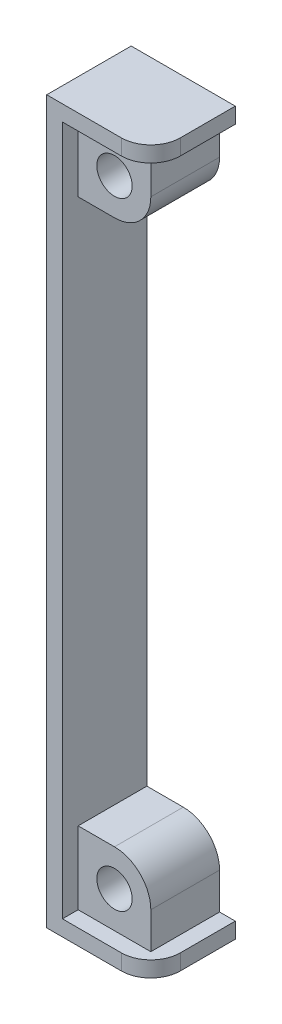
ISO-10303-21;
HEADER;
FILE_DESCRIPTION(('STEP AP214'),'2;1');
FILE_NAME('part.step','',(''),(''),'','','');
FILE_SCHEMA(('AUTOMOTIVE_DESIGN { 1 0 10303 214 1 1 1 1 }'));
ENDSEC;
DATA;
#1=APPLICATION_CONTEXT('core data for automotive mechanical design processes');
#2=APPLICATION_PROTOCOL_DEFINITION('international standard','automotive_design',2000,#1);
#3=PRODUCT_CONTEXT('',#1,'mechanical');
#4=PRODUCT('Part','Part','',(#3));
#5=PRODUCT_RELATED_PRODUCT_CATEGORY('part','',(#4));
#6=PRODUCT_DEFINITION_FORMATION('','',#4);
#7=PRODUCT_DEFINITION_CONTEXT('part definition',#1,'design');
#8=PRODUCT_DEFINITION('design','',#6,#7);
#9=PRODUCT_DEFINITION_SHAPE('','',#8);
#10=(LENGTH_UNIT() NAMED_UNIT(*) SI_UNIT(.MILLI.,.METRE.));
#11=(NAMED_UNIT(*) PLANE_ANGLE_UNIT() SI_UNIT($,.RADIAN.));
#12=(NAMED_UNIT(*) SI_UNIT($,.STERADIAN.) SOLID_ANGLE_UNIT());
#13=UNCERTAINTY_MEASURE_WITH_UNIT(LENGTH_MEASURE(1.E-05),#10,'distance_accuracy_value','');
#14=(GEOMETRIC_REPRESENTATION_CONTEXT(3) GLOBAL_UNCERTAINTY_ASSIGNED_CONTEXT((#13)) GLOBAL_UNIT_ASSIGNED_CONTEXT((#10,
#11,#12)) REPRESENTATION_CONTEXT('',''));
#15=CARTESIAN_POINT('',(0.,0.,0.));
#16=DIRECTION('',(0.,0.,1.));
#17=DIRECTION('',(1.,0.,0.));
#18=AXIS2_PLACEMENT_3D('',#15,#16,#17);
#19=CARTESIAN_POINT('',(1.60000000000001,0.,8.6));
#20=DIRECTION('',(1.,0.,0.));
#21=DIRECTION('',(0.,1.,0.));
#22=AXIS2_PLACEMENT_3D('',#19,#20,#21);
#23=PLANE('',#22);
#24=DIRECTION('',(0.,-1.,0.));
#25=VECTOR('',#24,1.);
#26=CARTESIAN_POINT('',(1.60000000000001,0.,7.));
#27=LINE('',#26,#25);
#28=CARTESIAN_POINT('',(1.60000000000001,9.,7.));
#29=VERTEX_POINT('',#28);
#30=CARTESIAN_POINT('',(1.60000000000001,1.6,7.));
#31=VERTEX_POINT('',#30);
#32=EDGE_CURVE('E188',#29,#31,#27,.T.);
#33=ORIENTED_EDGE('',*,*,#32,.F.);
#34=DIRECTION('',(0.,0.,-1.));
#35=VECTOR('',#34,1.);
#36=CARTESIAN_POINT('',(1.60000000000001,9.,7.));
#37=LINE('',#36,#35);
#38=CARTESIAN_POINT('',(1.60000000000001,9.,0.));
#39=VERTEX_POINT('',#38);
#40=EDGE_CURVE('E200',#29,#39,#37,.T.);
#41=ORIENTED_EDGE('',*,*,#40,.T.);
#42=DIRECTION('',(0.,-1.,0.));
#43=VECTOR('',#42,1.);
#44=CARTESIAN_POINT('',(1.60000000000001,0.,0.));
#45=LINE('',#44,#43);
#46=CARTESIAN_POINT('',(1.6,64.465,0.));
#47=VERTEX_POINT('',#46);
#48=EDGE_CURVE('E225',#47,#39,#45,.T.);
#49=ORIENTED_EDGE('',*,*,#48,.F.);
#50=DIRECTION('',(0.,0.,-1.));
#51=VECTOR('',#50,1.);
#52=CARTESIAN_POINT('',(1.6,64.465,7.));
#53=LINE('',#52,#51);
#54=CARTESIAN_POINT('',(1.6,64.465,7.));
#55=VERTEX_POINT('',#54);
#56=EDGE_CURVE('E281',#55,#47,#53,.T.);
#57=ORIENTED_EDGE('',*,*,#56,.F.);
#58=DIRECTION('',(0.,-1.,0.));
#59=VECTOR('',#58,1.);
#60=CARTESIAN_POINT('',(1.60000000000001,0.,7.));
#61=LINE('',#60,#59);
#62=CARTESIAN_POINT('',(1.6,71.865,7.));
#63=VERTEX_POINT('',#62);
#64=EDGE_CURVE('E278',#63,#55,#61,.T.);
#65=ORIENTED_EDGE('',*,*,#64,.F.);
#66=DIRECTION('',(0.,0.,-1.));
#67=VECTOR('',#66,1.);
#68=CARTESIAN_POINT('',(1.6,71.865,8.6));
#69=LINE('',#68,#67);
#70=CARTESIAN_POINT('',(1.6,71.865,8.6));
#71=VERTEX_POINT('',#70);
#72=EDGE_CURVE('E256',#71,#63,#69,.T.);
#73=ORIENTED_EDGE('',*,*,#72,.F.);
#74=DIRECTION('',(0.,-1.,0.));
#75=VECTOR('',#74,1.);
#76=CARTESIAN_POINT('',(1.60000000000001,0.,8.6));
#77=LINE('',#76,#75);
#78=CARTESIAN_POINT('',(1.60000000000001,1.6,8.6));
#79=VERTEX_POINT('',#78);
#80=EDGE_CURVE('E207',#71,#79,#77,.T.);
#81=ORIENTED_EDGE('',*,*,#80,.T.);
#82=DIRECTION('',(0.,0.,-1.));
#83=VECTOR('',#82,1.);
#84=CARTESIAN_POINT('',(1.60000000000001,1.6,8.6));
#85=LINE('',#84,#83);
#86=EDGE_CURVE('E259',#79,#31,#85,.T.);
#87=ORIENTED_EDGE('',*,*,#86,.T.);
#88=EDGE_LOOP('',(#33,#41,#49,#57,#65,#73,#81,#87));
#89=FACE_BOUND('',#88,.T.);
#90=ADVANCED_FACE('F33',(#89),#23,.T.);
#91=CARTESIAN_POINT('',(0.,64.465,7.));
#92=DIRECTION('',(0.,-1.,0.));
#93=DIRECTION('',(0.,0.,-1.));
#94=AXIS2_PLACEMENT_3D('',#91,#92,#93);
#95=PLANE('',#94);
#96=DIRECTION('',(-1.,0.,0.));
#97=VECTOR('',#96,1.);
#98=CARTESIAN_POINT('',(0.,64.465,0.));
#99=LINE('',#98,#97);
#100=CARTESIAN_POINT('',(5.30000000000001,64.465,0.));
#101=VERTEX_POINT('',#100);
#102=EDGE_CURVE('E284',#101,#47,#99,.T.);
#103=ORIENTED_EDGE('',*,*,#102,.F.);
#104=DIRECTION('',(0.,0.,-1.));
#105=VECTOR('',#104,1.);
#106=CARTESIAN_POINT('',(5.30000000000001,64.465,7.));
#107=LINE('',#106,#105);
#108=CARTESIAN_POINT('',(5.30000000000001,64.465,7.));
#109=VERTEX_POINT('',#108);
#110=EDGE_CURVE('E300',#109,#101,#107,.T.);
#111=ORIENTED_EDGE('',*,*,#110,.F.);
#112=DIRECTION('',(-1.,0.,0.));
#113=VECTOR('',#112,1.);
#114=CARTESIAN_POINT('',(0.,64.465,7.));
#115=LINE('',#114,#113);
#116=EDGE_CURVE('E266',#109,#55,#115,.T.);
#117=ORIENTED_EDGE('',*,*,#116,.T.);
#118=ORIENTED_EDGE('',*,*,#56,.T.);
#119=EDGE_LOOP('',(#103,#111,#117,#118));
#120=FACE_BOUND('',#119,.T.);
#121=ADVANCED_FACE('F364',(#120),#95,.T.);
#122=CARTESIAN_POINT('',(5.30000000000001,68.165,7.));
#123=DIRECTION('',(0.,0.,-1.));
#124=DIRECTION('',(-1.,0.,0.));
#125=AXIS2_PLACEMENT_3D('',#122,#123,#124);
#126=CYLINDRICAL_SURFACE('',#125,3.69999999999999);
#127=CARTESIAN_POINT('',(5.30000000000001,68.165,0.));
#128=DIRECTION('',(0.,0.,1.));
#129=DIRECTION('',(1.,0.,0.));
#130=AXIS2_PLACEMENT_3D('',#127,#128,#129);
#131=CIRCLE('',#130,3.69999999999999);
#132=CARTESIAN_POINT('',(9.,68.165,0.));
#133=VERTEX_POINT('',#132);
#134=EDGE_CURVE('E287',#101,#133,#131,.T.);
#135=ORIENTED_EDGE('',*,*,#134,.T.);
#136=DIRECTION('',(0.,0.,-1.));
#137=VECTOR('',#136,1.);
#138=CARTESIAN_POINT('',(9.,68.165,7.));
#139=LINE('',#138,#137);
#140=CARTESIAN_POINT('',(9.,68.165,7.));
#141=VERTEX_POINT('',#140);
#142=EDGE_CURVE('E297',#141,#133,#139,.T.);
#143=ORIENTED_EDGE('',*,*,#142,.F.);
#144=CARTESIAN_POINT('',(5.30000000000001,68.165,7.));
#145=DIRECTION('',(0.,0.,1.));
#146=DIRECTION('',(1.,0.,0.));
#147=AXIS2_PLACEMENT_3D('',#144,#145,#146);
#148=CIRCLE('',#147,3.69999999999999);
#149=EDGE_CURVE('E270',#109,#141,#148,.T.);
#150=ORIENTED_EDGE('',*,*,#149,.F.);
#151=ORIENTED_EDGE('',*,*,#110,.T.);
#152=EDGE_LOOP('',(#135,#143,#150,#151));
#153=FACE_BOUND('',#152,.T.);
#154=ADVANCED_FACE('F369',(#153),#126,.T.);
#155=CARTESIAN_POINT('',(9.,0.,7.));
#156=DIRECTION('',(-1.,0.,0.));
#157=DIRECTION('',(0.,0.,1.));
#158=AXIS2_PLACEMENT_3D('',#155,#156,#157);
#159=PLANE('',#158);
#160=DIRECTION('',(0.,1.,0.));
#161=VECTOR('',#160,1.);
#162=CARTESIAN_POINT('',(9.,0.,0.));
#163=LINE('',#162,#161);
#164=CARTESIAN_POINT('',(9.,71.865,0.));
#165=VERTEX_POINT('',#164);
#166=EDGE_CURVE('E267',#133,#165,#163,.T.);
#167=ORIENTED_EDGE('',*,*,#166,.T.);
#168=DIRECTION('',(0.,0.,-1.));
#169=VECTOR('',#168,1.);
#170=CARTESIAN_POINT('',(9.,71.865,7.));
#171=LINE('',#170,#169);
#172=CARTESIAN_POINT('',(9.00000000000001,71.865,7.));
#173=VERTEX_POINT('',#172);
#174=EDGE_CURVE('E294',#173,#165,#171,.T.);
#175=ORIENTED_EDGE('',*,*,#174,.F.);
#176=DIRECTION('',(0.,1.,0.));
#177=VECTOR('',#176,1.);
#178=CARTESIAN_POINT('',(9.,0.,7.));
#179=LINE('',#178,#177);
#180=EDGE_CURVE('E273',#141,#173,#179,.T.);
#181=ORIENTED_EDGE('',*,*,#180,.F.);
#182=ORIENTED_EDGE('',*,*,#142,.T.);
#183=EDGE_LOOP('',(#167,#175,#181,#182));
#184=FACE_BOUND('',#183,.T.);
#185=ADVANCED_FACE('F384',(#184),#159,.F.);
#186=CARTESIAN_POINT('',(5.30000000000001,68.165,7.));
#187=DIRECTION('',(0.,0.,-1.));
#188=DIRECTION('',(-1.,0.,0.));
#189=AXIS2_PLACEMENT_3D('',#186,#187,#188);
#190=CYLINDRICAL_SURFACE('',#189,1.8);
#191=CARTESIAN_POINT('',(5.30000000000001,68.165,7.));
#192=DIRECTION('',(0.,0.,1.));
#193=DIRECTION('',(1.,0.,0.));
#194=AXIS2_PLACEMENT_3D('',#191,#192,#193);
#195=CIRCLE('',#194,1.8);
#196=CARTESIAN_POINT('',(7.10000000000001,68.165,7.));
#197=VERTEX_POINT('',#196);
#198=EDGE_CURVE('E263',#197,#197,#195,.T.);
#199=ORIENTED_EDGE('',*,*,#198,.T.);
#200=EDGE_LOOP('',(#199));
#201=FACE_BOUND('',#200,.T.);
#202=CARTESIAN_POINT('',(5.30000000000001,68.165,0.));
#203=DIRECTION('',(0.,0.,1.));
#204=DIRECTION('',(1.,0.,0.));
#205=AXIS2_PLACEMENT_3D('',#202,#203,#204);
#206=CIRCLE('',#205,1.8);
#207=CARTESIAN_POINT('',(7.10000000000001,68.165,0.));
#208=VERTEX_POINT('',#207);
#209=EDGE_CURVE('E262',#208,#208,#206,.T.);
#210=ORIENTED_EDGE('',*,*,#209,.F.);
#211=EDGE_LOOP('',(#210));
#212=FACE_BOUND('',#211,.T.);
#213=ADVANCED_FACE('F380',(#201,#212),#190,.F.);
#214=CARTESIAN_POINT('',(0.,0.,7.));
#215=DIRECTION('',(0.,0.,1.));
#216=DIRECTION('',(1.,0.,0.));
#217=AXIS2_PLACEMENT_3D('',#214,#215,#216);
#218=PLANE('',#217);
#219=ORIENTED_EDGE('',*,*,#198,.F.);
#220=EDGE_LOOP('',(#219));
#221=FACE_BOUND('',#220,.T.);
#222=ORIENTED_EDGE('',*,*,#116,.F.);
#223=ORIENTED_EDGE('',*,*,#149,.T.);
#224=ORIENTED_EDGE('',*,*,#180,.T.);
#225=DIRECTION('',(1.,0.,0.));
#226=VECTOR('',#225,1.);
#227=CARTESIAN_POINT('',(0.,71.865,7.));
#228=LINE('',#227,#226);
#229=EDGE_CURVE('E276',#63,#173,#228,.T.);
#230=ORIENTED_EDGE('',*,*,#229,.F.);
#231=ORIENTED_EDGE('',*,*,#64,.T.);
#232=EDGE_LOOP('',(#222,#223,#224,#230,#231));
#233=FACE_BOUND('',#232,.T.);
#234=ADVANCED_FACE('F377',(#221,#233),#218,.T.);
#235=CARTESIAN_POINT('',(0.,0.,0.));
#236=DIRECTION('',(0.,0.,1.));
#237=DIRECTION('',(1.,0.,0.));
#238=AXIS2_PLACEMENT_3D('',#235,#236,#237);
#239=PLANE('',#238);
#240=DIRECTION('',(0.,-1.,0.));
#241=VECTOR('',#240,1.);
#242=CARTESIAN_POINT('',(9.00000000000001,0.,0.));
#243=LINE('',#242,#241);
#244=CARTESIAN_POINT('',(9.00000000000001,5.3,0.));
#245=VERTEX_POINT('',#244);
#246=CARTESIAN_POINT('',(9.00000000000001,1.6,0.));
#247=VERTEX_POINT('',#246);
#248=EDGE_CURVE('E163',#245,#247,#243,.T.);
#249=ORIENTED_EDGE('',*,*,#248,.T.);
#250=DIRECTION('',(1.,0.,0.));
#251=VECTOR('',#250,1.);
#252=CARTESIAN_POINT('',(0.,1.6,0.));
#253=LINE('',#252,#251);
#254=CARTESIAN_POINT('',(10.6,1.6,0.));
#255=VERTEX_POINT('',#254);
#256=EDGE_CURVE('E167',#247,#255,#253,.T.);
#257=ORIENTED_EDGE('',*,*,#256,.T.);
#258=DIRECTION('',(0.,1.,0.));
#259=VECTOR('',#258,1.);
#260=CARTESIAN_POINT('',(10.6,0.,0.));
#261=LINE('',#260,#259);
#262=CARTESIAN_POINT('',(10.6,0.,0.));
#263=VERTEX_POINT('',#262);
#264=EDGE_CURVE('E208',#263,#255,#261,.T.);
#265=ORIENTED_EDGE('',*,*,#264,.F.);
#266=DIRECTION('',(1.,0.,0.));
#267=VECTOR('',#266,1.);
#268=CARTESIAN_POINT('',(0.,0.,0.));
#269=LINE('',#268,#267);
#270=CARTESIAN_POINT('',(0.,0.,0.));
#271=VERTEX_POINT('',#270);
#272=EDGE_CURVE('E240',#271,#263,#269,.T.);
#273=ORIENTED_EDGE('',*,*,#272,.F.);
#274=DIRECTION('',(0.,1.,0.));
#275=VECTOR('',#274,1.);
#276=CARTESIAN_POINT('',(0.,0.,0.));
#277=LINE('',#276,#275);
#278=CARTESIAN_POINT('',(0.,73.465,0.));
#279=VERTEX_POINT('',#278);
#280=EDGE_CURVE('E237',#271,#279,#277,.T.);
#281=ORIENTED_EDGE('',*,*,#280,.T.);
#282=DIRECTION('',(1.,0.,0.));
#283=VECTOR('',#282,1.);
#284=CARTESIAN_POINT('',(0.,73.465,0.));
#285=LINE('',#284,#283);
#286=CARTESIAN_POINT('',(10.6,73.465,0.));
#287=VERTEX_POINT('',#286);
#288=EDGE_CURVE('E234',#279,#287,#285,.T.);
#289=ORIENTED_EDGE('',*,*,#288,.T.);
#290=DIRECTION('',(0.,1.,0.));
#291=VECTOR('',#290,1.);
#292=CARTESIAN_POINT('',(10.6,0.,0.));
#293=LINE('',#292,#291);
#294=CARTESIAN_POINT('',(10.6,71.865,0.));
#295=VERTEX_POINT('',#294);
#296=EDGE_CURVE('E231',#295,#287,#293,.T.);
#297=ORIENTED_EDGE('',*,*,#296,.F.);
#298=DIRECTION('',(1.,0.,0.));
#299=VECTOR('',#298,1.);
#300=CARTESIAN_POINT('',(0.,71.865,0.));
#301=LINE('',#300,#299);
#302=EDGE_CURVE('E228',#165,#295,#301,.T.);
#303=ORIENTED_EDGE('',*,*,#302,.F.);
#304=ORIENTED_EDGE('',*,*,#166,.F.);
#305=ORIENTED_EDGE('',*,*,#134,.F.);
#306=ORIENTED_EDGE('',*,*,#102,.T.);
#307=ORIENTED_EDGE('',*,*,#48,.T.);
#308=DIRECTION('',(-1.,0.,0.));
#309=VECTOR('',#308,1.);
#310=CARTESIAN_POINT('',(0.,9.,0.));
#311=LINE('',#310,#309);
#312=CARTESIAN_POINT('',(5.30000000000001,9.,0.));
#313=VERTEX_POINT('',#312);
#314=EDGE_CURVE('E184',#313,#39,#311,.T.);
#315=ORIENTED_EDGE('',*,*,#314,.F.);
#316=CARTESIAN_POINT('',(5.30000000000001,5.3,0.));
#317=DIRECTION('',(0.,0.,1.));
#318=DIRECTION('',(1.,0.,0.));
#319=AXIS2_PLACEMENT_3D('',#316,#317,#318);
#320=CIRCLE('',#319,3.7);
#321=EDGE_CURVE('E196',#245,#313,#320,.T.);
#322=ORIENTED_EDGE('',*,*,#321,.F.);
#323=EDGE_LOOP('',(#249,#257,#265,#273,#281,#289,#297,#303,#304,#305,#306,#307,#315,#322));
#324=FACE_BOUND('',#323,.T.);
#325=ORIENTED_EDGE('',*,*,#209,.T.);
#326=EDGE_LOOP('',(#325));
#327=FACE_BOUND('',#326,.T.);
#328=CARTESIAN_POINT('',(5.30000000000001,5.3,0.));
#329=DIRECTION('',(0.,0.,1.));
#330=DIRECTION('',(1.,0.,0.));
#331=AXIS2_PLACEMENT_3D('',#328,#329,#330);
#332=CIRCLE('',#331,1.8);
#333=CARTESIAN_POINT('',(7.10000000000001,5.3,0.));
#334=VERTEX_POINT('',#333);
#335=EDGE_CURVE('E192',#334,#334,#332,.T.);
#336=ORIENTED_EDGE('',*,*,#335,.T.);
#337=EDGE_LOOP('',(#336));
#338=FACE_BOUND('',#337,.T.);
#339=ADVANCED_FACE('F337',(#324,#327,#338),#239,.F.);
#340=CARTESIAN_POINT('',(0.,71.865,8.6));
#341=DIRECTION('',(0.,1.,0.));
#342=DIRECTION('',(0.,0.,1.));
#343=AXIS2_PLACEMENT_3D('',#340,#341,#342);
#344=PLANE('',#343);
#345=DIRECTION('',(0.,0.,-1.));
#346=VECTOR('',#345,1.);
#347=CARTESIAN_POINT('',(10.6,71.865,8.6));
#348=LINE('',#347,#346);
#349=CARTESIAN_POINT('',(10.6,71.865,5.6));
#350=VERTEX_POINT('',#349);
#351=EDGE_CURVE('E254',#350,#295,#348,.T.);
#352=ORIENTED_EDGE('',*,*,#351,.F.);
#353=CARTESIAN_POINT('',(7.60000000000002,71.865,5.6));
#354=DIRECTION('',(0.,1.,0.));
#355=DIRECTION('',(0.,0.,1.));
#356=AXIS2_PLACEMENT_3D('',#353,#354,#355);
#357=CIRCLE('',#356,3.);
#358=CARTESIAN_POINT('',(7.60000000000002,71.865,8.6));
#359=VERTEX_POINT('',#358);
#360=EDGE_CURVE('E11',#350,#359,#357,.F.);
#361=ORIENTED_EDGE('',*,*,#360,.T.);
#362=DIRECTION('',(1.,0.,0.));
#363=VECTOR('',#362,1.);
#364=CARTESIAN_POINT('',(0.,71.865,8.6));
#365=LINE('',#364,#363);
#366=EDGE_CURVE('E211',#71,#359,#365,.T.);
#367=ORIENTED_EDGE('',*,*,#366,.F.);
#368=ORIENTED_EDGE('',*,*,#72,.T.);
#369=ORIENTED_EDGE('',*,*,#229,.T.);
#370=ORIENTED_EDGE('',*,*,#174,.T.);
#371=ORIENTED_EDGE('',*,*,#302,.T.);
#372=EDGE_LOOP('',(#352,#361,#367,#368,#369,#370,#371));
#373=FACE_BOUND('',#372,.T.);
#374=ADVANCED_FACE('F348',(#373),#344,.F.);
#375=CARTESIAN_POINT('',(0.,1.6,8.6));
#376=DIRECTION('',(0.,1.,0.));
#377=DIRECTION('',(0.,0.,1.));
#378=AXIS2_PLACEMENT_3D('',#375,#376,#377);
#379=PLANE('',#378);
#380=DIRECTION('',(1.,0.,0.));
#381=VECTOR('',#380,1.);
#382=CARTESIAN_POINT('',(0.,1.6,8.6));
#383=LINE('',#382,#381);
#384=CARTESIAN_POINT('',(7.60000000000002,1.6,8.6));
#385=VERTEX_POINT('',#384);
#386=EDGE_CURVE('E204',#79,#385,#383,.T.);
#387=ORIENTED_EDGE('',*,*,#386,.T.);
#388=CARTESIAN_POINT('',(7.60000000000002,1.6,5.6));
#389=DIRECTION('',(0.,1.,0.));
#390=DIRECTION('',(0.,0.,1.));
#391=AXIS2_PLACEMENT_3D('',#388,#389,#390);
#392=CIRCLE('',#391,3.);
#393=CARTESIAN_POINT('',(10.6,1.6,5.6));
#394=VERTEX_POINT('',#393);
#395=EDGE_CURVE('E308',#385,#394,#392,.T.);
#396=ORIENTED_EDGE('',*,*,#395,.T.);
#397=DIRECTION('',(0.,0.,-1.));
#398=VECTOR('',#397,1.);
#399=CARTESIAN_POINT('',(10.6,1.6,8.6));
#400=LINE('',#399,#398);
#401=EDGE_CURVE('E222',#394,#255,#400,.T.);
#402=ORIENTED_EDGE('',*,*,#401,.T.);
#403=ORIENTED_EDGE('',*,*,#256,.F.);
#404=DIRECTION('',(0.,0.,-1.));
#405=VECTOR('',#404,1.);
#406=CARTESIAN_POINT('',(9.00000000000001,1.6,7.));
#407=LINE('',#406,#405);
#408=CARTESIAN_POINT('',(9.00000000000001,1.6,7.));
#409=VERTEX_POINT('',#408);
#410=EDGE_CURVE('E191',#409,#247,#407,.T.);
#411=ORIENTED_EDGE('',*,*,#410,.F.);
#412=DIRECTION('',(1.,0.,0.));
#413=VECTOR('',#412,1.);
#414=CARTESIAN_POINT('',(0.,1.6,7.));
#415=LINE('',#414,#413);
#416=EDGE_CURVE('E180',#31,#409,#415,.T.);
#417=ORIENTED_EDGE('',*,*,#416,.F.);
#418=ORIENTED_EDGE('',*,*,#86,.F.);
#419=EDGE_LOOP('',(#387,#396,#402,#403,#411,#417,#418));
#420=FACE_BOUND('',#419,.T.);
#421=ADVANCED_FACE('F330',(#420),#379,.T.);
#422=CARTESIAN_POINT('',(10.6,0.,8.6));
#423=DIRECTION('',(-1.,0.,0.));
#424=DIRECTION('',(0.,0.,1.));
#425=AXIS2_PLACEMENT_3D('',#422,#423,#424);
#426=PLANE('',#425);
#427=DIRECTION('',(0.,0.,-1.));
#428=VECTOR('',#427,1.);
#429=CARTESIAN_POINT('',(10.6,73.465,8.6));
#430=LINE('',#429,#428);
#431=CARTESIAN_POINT('',(10.6,73.465,5.6));
#432=VERTEX_POINT('',#431);
#433=EDGE_CURVE('E252',#432,#287,#430,.T.);
#434=ORIENTED_EDGE('',*,*,#433,.F.);
#435=DIRECTION('',(0.,1.,0.));
#436=VECTOR('',#435,1.);
#437=CARTESIAN_POINT('',(10.6,71.865,5.6));
#438=LINE('',#437,#436);
#439=EDGE_CURVE('E41',#432,#350,#438,.F.);
#440=ORIENTED_EDGE('',*,*,#439,.T.);
#441=ORIENTED_EDGE('',*,*,#351,.T.);
#442=ORIENTED_EDGE('',*,*,#296,.T.);
#443=EDGE_LOOP('',(#434,#440,#441,#442));
#444=FACE_BOUND('',#443,.T.);
#445=ADVANCED_FACE('F350',(#444),#426,.F.);
#446=CARTESIAN_POINT('',(0.,73.465,8.6));
#447=DIRECTION('',(0.,1.,0.));
#448=DIRECTION('',(0.,0.,1.));
#449=AXIS2_PLACEMENT_3D('',#446,#447,#448);
#450=PLANE('',#449);
#451=DIRECTION('',(1.,0.,0.));
#452=VECTOR('',#451,1.);
#453=CARTESIAN_POINT('',(0.,73.465,8.6));
#454=LINE('',#453,#452);
#455=CARTESIAN_POINT('',(0.,73.465,8.6));
#456=VERTEX_POINT('',#455);
#457=CARTESIAN_POINT('',(7.60000000000002,73.465,8.6));
#458=VERTEX_POINT('',#457);
#459=EDGE_CURVE('E214',#456,#458,#454,.T.);
#460=ORIENTED_EDGE('',*,*,#459,.T.);
#461=CARTESIAN_POINT('',(7.60000000000002,73.465,5.6));
#462=DIRECTION('',(0.,1.,0.));
#463=DIRECTION('',(0.,0.,1.));
#464=AXIS2_PLACEMENT_3D('',#461,#462,#463);
#465=CIRCLE('',#464,3.);
#466=EDGE_CURVE('E55',#458,#432,#465,.T.);
#467=ORIENTED_EDGE('',*,*,#466,.T.);
#468=ORIENTED_EDGE('',*,*,#433,.T.);
#469=ORIENTED_EDGE('',*,*,#288,.F.);
#470=DIRECTION('',(0.,0.,-1.));
#471=VECTOR('',#470,1.);
#472=CARTESIAN_POINT('',(0.,73.465,8.6));
#473=LINE('',#472,#471);
#474=EDGE_CURVE('E250',#456,#279,#473,.T.);
#475=ORIENTED_EDGE('',*,*,#474,.F.);
#476=EDGE_LOOP('',(#460,#467,#468,#469,#475));
#477=FACE_BOUND('',#476,.T.);
#478=ADVANCED_FACE('F352',(#477),#450,.T.);
#479=CARTESIAN_POINT('',(0.,0.,8.6));
#480=DIRECTION('',(-1.,0.,0.));
#481=DIRECTION('',(0.,0.,1.));
#482=AXIS2_PLACEMENT_3D('',#479,#480,#481);
#483=PLANE('',#482);
#484=ORIENTED_EDGE('',*,*,#280,.F.);
#485=DIRECTION('',(0.,0.,-1.));
#486=VECTOR('',#485,1.);
#487=CARTESIAN_POINT('',(0.,0.,8.6));
#488=LINE('',#487,#486);
#489=CARTESIAN_POINT('',(0.,0.,8.6));
#490=VERTEX_POINT('',#489);
#491=EDGE_CURVE('E248',#490,#271,#488,.T.);
#492=ORIENTED_EDGE('',*,*,#491,.F.);
#493=DIRECTION('',(0.,1.,0.));
#494=VECTOR('',#493,1.);
#495=CARTESIAN_POINT('',(0.,0.,8.6));
#496=LINE('',#495,#494);
#497=EDGE_CURVE('E216',#490,#456,#496,.T.);
#498=ORIENTED_EDGE('',*,*,#497,.T.);
#499=ORIENTED_EDGE('',*,*,#474,.T.);
#500=EDGE_LOOP('',(#484,#492,#498,#499));
#501=FACE_BOUND('',#500,.T.);
#502=ADVANCED_FACE('F354',(#501),#483,.T.);
#503=CARTESIAN_POINT('',(0.,0.,8.6));
#504=DIRECTION('',(0.,1.,0.));
#505=DIRECTION('',(0.,0.,1.));
#506=AXIS2_PLACEMENT_3D('',#503,#504,#505);
#507=PLANE('',#506);
#508=DIRECTION('',(0.,0.,-1.));
#509=VECTOR('',#508,1.);
#510=CARTESIAN_POINT('',(10.6,0.,8.6));
#511=LINE('',#510,#509);
#512=CARTESIAN_POINT('',(10.6,0.,5.6));
#513=VERTEX_POINT('',#512);
#514=EDGE_CURVE('E246',#513,#263,#511,.T.);
#515=ORIENTED_EDGE('',*,*,#514,.F.);
#516=CARTESIAN_POINT('',(7.60000000000002,0.,5.6));
#517=DIRECTION('',(0.,1.,0.));
#518=DIRECTION('',(0.,0.,1.));
#519=AXIS2_PLACEMENT_3D('',#516,#517,#518);
#520=CIRCLE('',#519,3.);
#521=CARTESIAN_POINT('',(7.60000000000002,0.,8.6));
#522=VERTEX_POINT('',#521);
#523=EDGE_CURVE('E312',#513,#522,#520,.F.);
#524=ORIENTED_EDGE('',*,*,#523,.T.);
#525=DIRECTION('',(1.,0.,0.));
#526=VECTOR('',#525,1.);
#527=CARTESIAN_POINT('',(0.,0.,8.6));
#528=LINE('',#527,#526);
#529=EDGE_CURVE('E219',#490,#522,#528,.T.);
#530=ORIENTED_EDGE('',*,*,#529,.F.);
#531=ORIENTED_EDGE('',*,*,#491,.T.);
#532=ORIENTED_EDGE('',*,*,#272,.T.);
#533=EDGE_LOOP('',(#515,#524,#530,#531,#532));
#534=FACE_BOUND('',#533,.T.);
#535=ADVANCED_FACE('F318',(#534),#507,.F.);
#536=CARTESIAN_POINT('',(10.6,0.,8.6));
#537=DIRECTION('',(-1.,0.,0.));
#538=DIRECTION('',(0.,0.,1.));
#539=AXIS2_PLACEMENT_3D('',#536,#537,#538);
#540=PLANE('',#539);
#541=ORIENTED_EDGE('',*,*,#401,.F.);
#542=DIRECTION('',(0.,1.,0.));
#543=VECTOR('',#542,1.);
#544=CARTESIAN_POINT('',(10.6,0.,5.6));
#545=LINE('',#544,#543);
#546=EDGE_CURVE('E310',#394,#513,#545,.F.);
#547=ORIENTED_EDGE('',*,*,#546,.T.);
#548=ORIENTED_EDGE('',*,*,#514,.T.);
#549=ORIENTED_EDGE('',*,*,#264,.T.);
#550=EDGE_LOOP('',(#541,#547,#548,#549));
#551=FACE_BOUND('',#550,.T.);
#552=ADVANCED_FACE('F333',(#551),#540,.F.);
#553=CARTESIAN_POINT('',(0.,0.,8.6));
#554=DIRECTION('',(0.,0.,1.));
#555=DIRECTION('',(1.,0.,0.));
#556=AXIS2_PLACEMENT_3D('',#553,#554,#555);
#557=PLANE('',#556);
#558=ORIENTED_EDGE('',*,*,#529,.T.);
#559=DIRECTION('',(0.,1.,0.));
#560=VECTOR('',#559,1.);
#561=CARTESIAN_POINT('',(7.60000000000002,1.6,8.6));
#562=LINE('',#561,#560);
#563=EDGE_CURVE('E305',#522,#385,#562,.T.);
#564=ORIENTED_EDGE('',*,*,#563,.T.);
#565=ORIENTED_EDGE('',*,*,#386,.F.);
#566=ORIENTED_EDGE('',*,*,#80,.F.);
#567=ORIENTED_EDGE('',*,*,#366,.T.);
#568=DIRECTION('',(0.,1.,0.));
#569=VECTOR('',#568,1.);
#570=CARTESIAN_POINT('',(7.60000000000002,73.465,8.6));
#571=LINE('',#570,#569);
#572=EDGE_CURVE('E302',#359,#458,#571,.T.);
#573=ORIENTED_EDGE('',*,*,#572,.T.);
#574=ORIENTED_EDGE('',*,*,#459,.F.);
#575=ORIENTED_EDGE('',*,*,#497,.F.);
#576=EDGE_LOOP('',(#558,#564,#565,#566,#567,#573,#574,#575));
#577=FACE_BOUND('',#576,.T.);
#578=ADVANCED_FACE('F324',(#577),#557,.T.);
#579=CARTESIAN_POINT('',(9.00000000000001,0.,7.));
#580=DIRECTION('',(1.,0.,0.));
#581=DIRECTION('',(0.,0.,-1.));
#582=AXIS2_PLACEMENT_3D('',#579,#580,#581);
#583=PLANE('',#582);
#584=ORIENTED_EDGE('',*,*,#248,.F.);
#585=DIRECTION('',(0.,0.,-1.));
#586=VECTOR('',#585,1.);
#587=CARTESIAN_POINT('',(9.00000000000001,5.3,7.));
#588=LINE('',#587,#586);
#589=CARTESIAN_POINT('',(9.00000000000001,5.3,7.));
#590=VERTEX_POINT('',#589);
#591=EDGE_CURVE('E156',#590,#245,#588,.T.);
#592=ORIENTED_EDGE('',*,*,#591,.F.);
#593=DIRECTION('',(0.,-1.,0.));
#594=VECTOR('',#593,1.);
#595=CARTESIAN_POINT('',(9.00000000000001,0.,7.));
#596=LINE('',#595,#594);
#597=EDGE_CURVE('E160',#590,#409,#596,.T.);
#598=ORIENTED_EDGE('',*,*,#597,.T.);
#599=ORIENTED_EDGE('',*,*,#410,.T.);
#600=EDGE_LOOP('',(#584,#592,#598,#599));
#601=FACE_BOUND('',#600,.T.);
#602=ADVANCED_FACE('F158',(#601),#583,.T.);
#603=CARTESIAN_POINT('',(5.30000000000001,5.3,7.));
#604=DIRECTION('',(0.,0.,-1.));
#605=DIRECTION('',(-1.,0.,0.));
#606=AXIS2_PLACEMENT_3D('',#603,#604,#605);
#607=CYLINDRICAL_SURFACE('',#606,3.7);
#608=ORIENTED_EDGE('',*,*,#321,.T.);
#609=DIRECTION('',(0.,0.,-1.));
#610=VECTOR('',#609,1.);
#611=CARTESIAN_POINT('',(5.30000000000001,9.,7.));
#612=LINE('',#611,#610);
#613=CARTESIAN_POINT('',(5.30000000000001,9.,7.));
#614=VERTEX_POINT('',#613);
#615=EDGE_CURVE('E168',#614,#313,#612,.T.);
#616=ORIENTED_EDGE('',*,*,#615,.F.);
#617=CARTESIAN_POINT('',(5.30000000000001,5.3,7.));
#618=DIRECTION('',(0.,0.,1.));
#619=DIRECTION('',(1.,0.,0.));
#620=AXIS2_PLACEMENT_3D('',#617,#618,#619);
#621=CIRCLE('',#620,3.7);
#622=EDGE_CURVE('E172',#590,#614,#621,.T.);
#623=ORIENTED_EDGE('',*,*,#622,.F.);
#624=ORIENTED_EDGE('',*,*,#591,.T.);
#625=EDGE_LOOP('',(#608,#616,#623,#624));
#626=FACE_BOUND('',#625,.T.);
#627=ADVANCED_FACE('F173',(#626),#607,.T.);
#628=CARTESIAN_POINT('',(0.,9.,7.));
#629=DIRECTION('',(0.,-1.,0.));
#630=DIRECTION('',(1.,0.,0.));
#631=AXIS2_PLACEMENT_3D('',#628,#629,#630);
#632=PLANE('',#631);
#633=ORIENTED_EDGE('',*,*,#314,.T.);
#634=ORIENTED_EDGE('',*,*,#40,.F.);
#635=DIRECTION('',(-1.,0.,0.));
#636=VECTOR('',#635,1.);
#637=CARTESIAN_POINT('',(0.,9.,7.));
#638=LINE('',#637,#636);
#639=EDGE_CURVE('E176',#614,#29,#638,.T.);
#640=ORIENTED_EDGE('',*,*,#639,.F.);
#641=ORIENTED_EDGE('',*,*,#615,.T.);
#642=EDGE_LOOP('',(#633,#634,#640,#641));
#643=FACE_BOUND('',#642,.T.);
#644=ADVANCED_FACE('F404',(#643),#632,.F.);
#645=CARTESIAN_POINT('',(5.30000000000001,5.3,7.));
#646=DIRECTION('',(0.,0.,-1.));
#647=DIRECTION('',(-1.,0.,0.));
#648=AXIS2_PLACEMENT_3D('',#645,#646,#647);
#649=CYLINDRICAL_SURFACE('',#648,1.8);
#650=CARTESIAN_POINT('',(5.30000000000001,5.3,7.));
#651=DIRECTION('',(0.,0.,1.));
#652=DIRECTION('',(1.,0.,0.));
#653=AXIS2_PLACEMENT_3D('',#650,#651,#652);
#654=CIRCLE('',#653,1.8);
#655=CARTESIAN_POINT('',(7.10000000000001,5.3,7.));
#656=VERTEX_POINT('',#655);
#657=EDGE_CURVE('E181',#656,#656,#654,.T.);
#658=ORIENTED_EDGE('',*,*,#657,.T.);
#659=EDGE_LOOP('',(#658));
#660=FACE_BOUND('',#659,.T.);
#661=ORIENTED_EDGE('',*,*,#335,.F.);
#662=EDGE_LOOP('',(#661));
#663=FACE_BOUND('',#662,.T.);
#664=ADVANCED_FACE('F398',(#660,#663),#649,.F.);
#665=CARTESIAN_POINT('',(0.,0.,7.));
#666=DIRECTION('',(0.,0.,1.));
#667=DIRECTION('',(1.,0.,0.));
#668=AXIS2_PLACEMENT_3D('',#665,#666,#667);
#669=PLANE('',#668);
#670=ORIENTED_EDGE('',*,*,#657,.F.);
#671=EDGE_LOOP('',(#670));
#672=FACE_BOUND('',#671,.T.);
#673=ORIENTED_EDGE('',*,*,#597,.F.);
#674=ORIENTED_EDGE('',*,*,#622,.T.);
#675=ORIENTED_EDGE('',*,*,#639,.T.);
#676=ORIENTED_EDGE('',*,*,#32,.T.);
#677=ORIENTED_EDGE('',*,*,#416,.T.);
#678=EDGE_LOOP('',(#673,#674,#675,#676,#677));
#679=FACE_BOUND('',#678,.T.);
#680=ADVANCED_FACE('F178',(#672,#679),#669,.T.);
#681=CARTESIAN_POINT('',(7.60000000000002,0.,5.6));
#682=DIRECTION('',(0.,-1.,0.));
#683=DIRECTION('',(0.,0.,-1.));
#684=AXIS2_PLACEMENT_3D('',#681,#682,#683);
#685=CYLINDRICAL_SURFACE('',#684,3.);
#686=ORIENTED_EDGE('',*,*,#523,.F.);
#687=ORIENTED_EDGE('',*,*,#546,.F.);
#688=ORIENTED_EDGE('',*,*,#395,.F.);
#689=ORIENTED_EDGE('',*,*,#563,.F.);
#690=EDGE_LOOP('',(#686,#687,#688,#689));
#691=FACE_BOUND('',#690,.T.);
#692=ADVANCED_FACE('F327',(#691),#685,.T.);
#693=CARTESIAN_POINT('',(7.60000000000002,0.,5.6));
#694=DIRECTION('',(0.,-1.,0.));
#695=DIRECTION('',(0.,0.,-1.));
#696=AXIS2_PLACEMENT_3D('',#693,#694,#695);
#697=CYLINDRICAL_SURFACE('',#696,3.);
#698=ORIENTED_EDGE('',*,*,#360,.F.);
#699=ORIENTED_EDGE('',*,*,#439,.F.);
#700=ORIENTED_EDGE('',*,*,#466,.F.);
#701=ORIENTED_EDGE('',*,*,#572,.F.);
#702=EDGE_LOOP('',(#698,#699,#700,#701));
#703=FACE_BOUND('',#702,.T.);
#704=ADVANCED_FACE('F35',(#703),#697,.T.);
#705=CLOSED_SHELL('',(#90,#121,#154,#185,#213,#234,#339,#374,#421,#445,#478,#502,#535,#552,#578,
#602,#627,#644,#664,#680,#692,#704));
#706=MANIFOLD_SOLID_BREP('B2',#705);
#707=ADVANCED_BREP_SHAPE_REPRESENTATION('',(#18,#706),#14);
#708=SHAPE_DEFINITION_REPRESENTATION(#9,#707);
ENDSEC;
END-ISO-10303-21;
